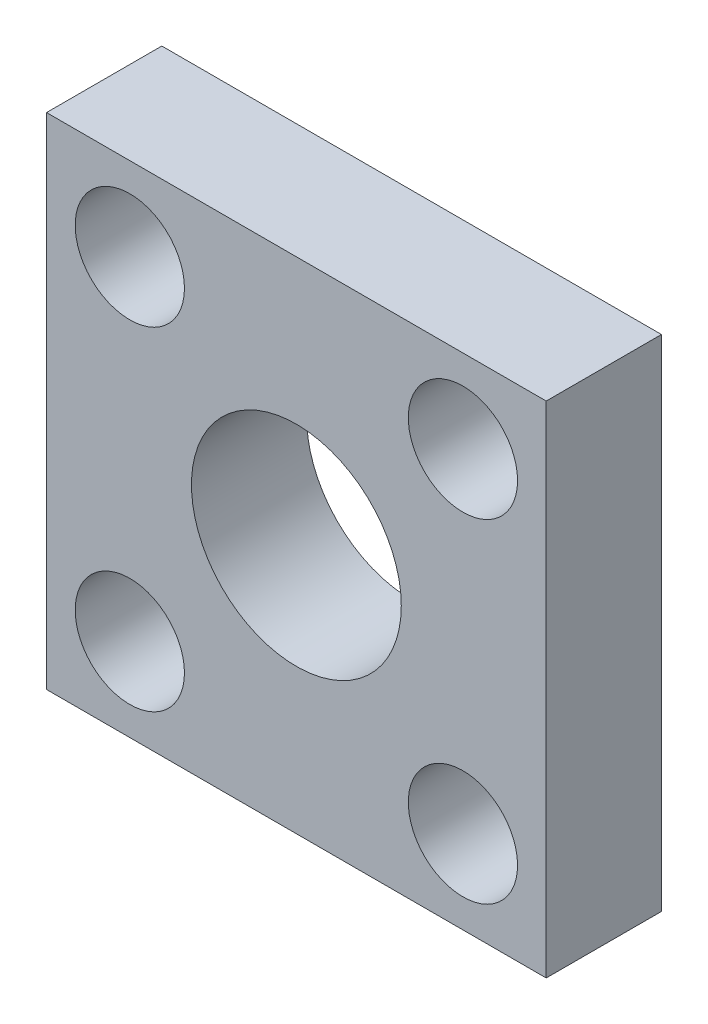
ISO-10303-21;
HEADER;
FILE_DESCRIPTION(('STEP AP214'),'2;1');
FILE_NAME('part.step','',(''),(''),'','','');
FILE_SCHEMA(('AUTOMOTIVE_DESIGN { 1 0 10303 214 1 1 1 1 }'));
ENDSEC;
DATA;
#1=APPLICATION_CONTEXT('core data for automotive mechanical design processes');
#2=APPLICATION_PROTOCOL_DEFINITION('international standard','automotive_design',2000,#1);
#3=PRODUCT_CONTEXT('',#1,'mechanical');
#4=PRODUCT('Part','Part','',(#3));
#5=PRODUCT_RELATED_PRODUCT_CATEGORY('part','',(#4));
#6=PRODUCT_DEFINITION_FORMATION('','',#4);
#7=PRODUCT_DEFINITION_CONTEXT('part definition',#1,'design');
#8=PRODUCT_DEFINITION('design','',#6,#7);
#9=PRODUCT_DEFINITION_SHAPE('','',#8);
#10=(LENGTH_UNIT() NAMED_UNIT(*) SI_UNIT(.MILLI.,.METRE.));
#11=(NAMED_UNIT(*) PLANE_ANGLE_UNIT() SI_UNIT($,.RADIAN.));
#12=(NAMED_UNIT(*) SI_UNIT($,.STERADIAN.) SOLID_ANGLE_UNIT());
#13=UNCERTAINTY_MEASURE_WITH_UNIT(LENGTH_MEASURE(1.E-05),#10,'distance_accuracy_value','');
#14=(GEOMETRIC_REPRESENTATION_CONTEXT(3) GLOBAL_UNCERTAINTY_ASSIGNED_CONTEXT((#13)) GLOBAL_UNIT_ASSIGNED_CONTEXT((#10,
#11,#12)) REPRESENTATION_CONTEXT('',''));
#15=CARTESIAN_POINT('',(0.,0.,0.));
#16=DIRECTION('',(0.,0.,1.));
#17=DIRECTION('',(1.,0.,0.));
#18=AXIS2_PLACEMENT_3D('',#15,#16,#17);
#19=CARTESIAN_POINT('',(0.,0.,4.3942));
#20=DIRECTION('',(0.,0.,-1.));
#21=DIRECTION('',(-1.,0.,0.));
#22=AXIS2_PLACEMENT_3D('',#19,#20,#21);
#23=PLANE('',#22);
#24=CARTESIAN_POINT('',(15.875,3.175,4.3942));
#25=DIRECTION('',(0.,0.,1.));
#26=DIRECTION('',(1.,0.,0.));
#27=AXIS2_PLACEMENT_3D('',#24,#25,#26);
#28=CIRCLE('',#27,2.0828);
#29=CARTESIAN_POINT('',(17.9578,3.175,4.3942));
#30=VERTEX_POINT('',#29);
#31=EDGE_CURVE('E127',#30,#30,#28,.T.);
#32=ORIENTED_EDGE('',*,*,#31,.F.);
#33=EDGE_LOOP('',(#32));
#34=FACE_BOUND('',#33,.T.);
#35=CARTESIAN_POINT('',(3.175,15.875,4.3942));
#36=DIRECTION('',(0.,0.,1.));
#37=DIRECTION('',(1.,0.,0.));
#38=AXIS2_PLACEMENT_3D('',#35,#36,#37);
#39=CIRCLE('',#38,2.08280000000002);
#40=CARTESIAN_POINT('',(5.25780000000002,15.875,4.3942));
#41=VERTEX_POINT('',#40);
#42=EDGE_CURVE('E115',#41,#41,#39,.T.);
#43=ORIENTED_EDGE('',*,*,#42,.F.);
#44=EDGE_LOOP('',(#43));
#45=FACE_BOUND('',#44,.T.);
#46=DIRECTION('',(0.,-1.,0.));
#47=VECTOR('',#46,1.);
#48=CARTESIAN_POINT('',(0.,0.,4.3942));
#49=LINE('',#48,#47);
#50=CARTESIAN_POINT('',(0.,19.05,4.3942));
#51=VERTEX_POINT('',#50);
#52=CARTESIAN_POINT('',(0.,0.,4.3942));
#53=VERTEX_POINT('',#52);
#54=EDGE_CURVE('E85',#51,#53,#49,.T.);
#55=ORIENTED_EDGE('',*,*,#54,.T.);
#56=DIRECTION('',(1.,0.,0.));
#57=VECTOR('',#56,1.);
#58=CARTESIAN_POINT('',(0.,0.,4.3942));
#59=LINE('',#58,#57);
#60=CARTESIAN_POINT('',(19.05,0.,4.3942));
#61=VERTEX_POINT('',#60);
#62=EDGE_CURVE('E80',#53,#61,#59,.T.);
#63=ORIENTED_EDGE('',*,*,#62,.T.);
#64=DIRECTION('',(0.,1.,0.));
#65=VECTOR('',#64,1.);
#66=CARTESIAN_POINT('',(19.05,0.,4.3942));
#67=LINE('',#66,#65);
#68=CARTESIAN_POINT('',(19.05,19.05,4.3942));
#69=VERTEX_POINT('',#68);
#70=EDGE_CURVE('E83',#61,#69,#67,.T.);
#71=ORIENTED_EDGE('',*,*,#70,.T.);
#72=DIRECTION('',(-1.,0.,0.));
#73=VECTOR('',#72,1.);
#74=CARTESIAN_POINT('',(0.,19.05,4.3942));
#75=LINE('',#74,#73);
#76=EDGE_CURVE('E50',#69,#51,#75,.T.);
#77=ORIENTED_EDGE('',*,*,#76,.T.);
#78=EDGE_LOOP('',(#55,#63,#71,#77));
#79=FACE_BOUND('',#78,.T.);
#80=CARTESIAN_POINT('',(3.175,3.175,4.3942));
#81=DIRECTION('',(0.,0.,1.));
#82=DIRECTION('',(1.,0.,0.));
#83=AXIS2_PLACEMENT_3D('',#80,#81,#82);
#84=CIRCLE('',#83,2.0828);
#85=CARTESIAN_POINT('',(5.2578,3.175,4.3942));
#86=VERTEX_POINT('',#85);
#87=EDGE_CURVE('E100',#86,#86,#84,.T.);
#88=ORIENTED_EDGE('',*,*,#87,.F.);
#89=EDGE_LOOP('',(#88));
#90=FACE_BOUND('',#89,.T.);
#91=CARTESIAN_POINT('',(15.875,15.875,4.3942));
#92=DIRECTION('',(0.,0.,1.));
#93=DIRECTION('',(1.,0.,0.));
#94=AXIS2_PLACEMENT_3D('',#91,#92,#93);
#95=CIRCLE('',#94,2.0828);
#96=CARTESIAN_POINT('',(17.9578,15.875,4.3942));
#97=VERTEX_POINT('',#96);
#98=EDGE_CURVE('E121',#97,#97,#95,.T.);
#99=ORIENTED_EDGE('',*,*,#98,.F.);
#100=EDGE_LOOP('',(#99));
#101=FACE_BOUND('',#100,.T.);
#102=CARTESIAN_POINT('',(9.525,9.525,4.3942));
#103=DIRECTION('',(0.,0.,1.));
#104=DIRECTION('',(1.,0.,0.));
#105=AXIS2_PLACEMENT_3D('',#102,#103,#104);
#106=CIRCLE('',#105,4.);
#107=CARTESIAN_POINT('',(13.525,9.525,4.3942));
#108=VERTEX_POINT('',#107);
#109=EDGE_CURVE('E133',#108,#108,#106,.T.);
#110=ORIENTED_EDGE('',*,*,#109,.F.);
#111=EDGE_LOOP('',(#110));
#112=FACE_BOUND('',#111,.T.);
#113=ADVANCED_FACE('F33',(#34,#45,#79,#90,#101,#112),#23,.F.);
#114=CARTESIAN_POINT('',(0.,0.,0.));
#115=DIRECTION('',(0.,0.,-1.));
#116=DIRECTION('',(-1.,0.,0.));
#117=AXIS2_PLACEMENT_3D('',#114,#115,#116);
#118=PLANE('',#117);
#119=CARTESIAN_POINT('',(15.875,3.175,0.));
#120=DIRECTION('',(0.,0.,1.));
#121=DIRECTION('',(1.,0.,0.));
#122=AXIS2_PLACEMENT_3D('',#119,#120,#121);
#123=CIRCLE('',#122,2.0828);
#124=CARTESIAN_POINT('',(17.9578,3.175,0.));
#125=VERTEX_POINT('',#124);
#126=EDGE_CURVE('E130',#125,#125,#123,.T.);
#127=ORIENTED_EDGE('',*,*,#126,.T.);
#128=EDGE_LOOP('',(#127));
#129=FACE_BOUND('',#128,.T.);
#130=CARTESIAN_POINT('',(3.175,15.875,0.));
#131=DIRECTION('',(0.,0.,1.));
#132=DIRECTION('',(1.,0.,0.));
#133=AXIS2_PLACEMENT_3D('',#130,#131,#132);
#134=CIRCLE('',#133,2.08280000000002);
#135=CARTESIAN_POINT('',(5.25780000000002,15.875,0.));
#136=VERTEX_POINT('',#135);
#137=EDGE_CURVE('E118',#136,#136,#134,.T.);
#138=ORIENTED_EDGE('',*,*,#137,.T.);
#139=EDGE_LOOP('',(#138));
#140=FACE_BOUND('',#139,.T.);
#141=DIRECTION('',(0.,-1.,0.));
#142=VECTOR('',#141,1.);
#143=CARTESIAN_POINT('',(0.,0.,0.));
#144=LINE('',#143,#142);
#145=CARTESIAN_POINT('',(0.,19.05,0.));
#146=VERTEX_POINT('',#145);
#147=CARTESIAN_POINT('',(0.,0.,0.));
#148=VERTEX_POINT('',#147);
#149=EDGE_CURVE('E97',#146,#148,#144,.T.);
#150=ORIENTED_EDGE('',*,*,#149,.F.);
#151=DIRECTION('',(-1.,0.,0.));
#152=VECTOR('',#151,1.);
#153=CARTESIAN_POINT('',(0.,19.05,0.));
#154=LINE('',#153,#152);
#155=CARTESIAN_POINT('',(19.05,19.05,0.));
#156=VERTEX_POINT('',#155);
#157=EDGE_CURVE('E73',#156,#146,#154,.T.);
#158=ORIENTED_EDGE('',*,*,#157,.F.);
#159=DIRECTION('',(0.,1.,0.));
#160=VECTOR('',#159,1.);
#161=CARTESIAN_POINT('',(19.05,0.,0.));
#162=LINE('',#161,#160);
#163=CARTESIAN_POINT('',(19.05,0.,0.));
#164=VERTEX_POINT('',#163);
#165=EDGE_CURVE('E67',#164,#156,#162,.T.);
#166=ORIENTED_EDGE('',*,*,#165,.F.);
#167=DIRECTION('',(1.,0.,0.));
#168=VECTOR('',#167,1.);
#169=CARTESIAN_POINT('',(0.,0.,0.));
#170=LINE('',#169,#168);
#171=EDGE_CURVE('E89',#148,#164,#170,.T.);
#172=ORIENTED_EDGE('',*,*,#171,.F.);
#173=EDGE_LOOP('',(#150,#158,#166,#172));
#174=FACE_BOUND('',#173,.T.);
#175=CARTESIAN_POINT('',(3.175,3.175,0.));
#176=DIRECTION('',(0.,0.,1.));
#177=DIRECTION('',(1.,0.,0.));
#178=AXIS2_PLACEMENT_3D('',#175,#176,#177);
#179=CIRCLE('',#178,2.0828);
#180=CARTESIAN_POINT('',(5.2578,3.175,0.));
#181=VERTEX_POINT('',#180);
#182=EDGE_CURVE('E112',#181,#181,#179,.T.);
#183=ORIENTED_EDGE('',*,*,#182,.T.);
#184=EDGE_LOOP('',(#183));
#185=FACE_BOUND('',#184,.T.);
#186=CARTESIAN_POINT('',(15.875,15.875,0.));
#187=DIRECTION('',(0.,0.,1.));
#188=DIRECTION('',(1.,0.,0.));
#189=AXIS2_PLACEMENT_3D('',#186,#187,#188);
#190=CIRCLE('',#189,2.0828);
#191=CARTESIAN_POINT('',(17.9578,15.875,0.));
#192=VERTEX_POINT('',#191);
#193=EDGE_CURVE('E124',#192,#192,#190,.T.);
#194=ORIENTED_EDGE('',*,*,#193,.T.);
#195=EDGE_LOOP('',(#194));
#196=FACE_BOUND('',#195,.T.);
#197=CARTESIAN_POINT('',(9.525,9.525,0.));
#198=DIRECTION('',(0.,0.,1.));
#199=DIRECTION('',(1.,0.,0.));
#200=AXIS2_PLACEMENT_3D('',#197,#198,#199);
#201=CIRCLE('',#200,4.);
#202=CARTESIAN_POINT('',(13.525,9.525,0.));
#203=VERTEX_POINT('',#202);
#204=EDGE_CURVE('E136',#203,#203,#201,.T.);
#205=ORIENTED_EDGE('',*,*,#204,.T.);
#206=EDGE_LOOP('',(#205));
#207=FACE_BOUND('',#206,.T.);
#208=ADVANCED_FACE('F108',(#129,#140,#174,#185,#196,#207),#118,.T.);
#209=CARTESIAN_POINT('',(0.,0.,4.3942));
#210=DIRECTION('',(1.,0.,0.));
#211=DIRECTION('',(0.,0.,-1.));
#212=AXIS2_PLACEMENT_3D('',#209,#210,#211);
#213=PLANE('',#212);
#214=ORIENTED_EDGE('',*,*,#149,.T.);
#215=DIRECTION('',(0.,0.,-1.));
#216=VECTOR('',#215,1.);
#217=CARTESIAN_POINT('',(0.,0.,4.3942));
#218=LINE('',#217,#216);
#219=EDGE_CURVE('E11',#53,#148,#218,.T.);
#220=ORIENTED_EDGE('',*,*,#219,.F.);
#221=ORIENTED_EDGE('',*,*,#54,.F.);
#222=DIRECTION('',(0.,0.,-1.));
#223=VECTOR('',#222,1.);
#224=CARTESIAN_POINT('',(0.,19.05,4.3942));
#225=LINE('',#224,#223);
#226=EDGE_CURVE('E93',#51,#146,#225,.T.);
#227=ORIENTED_EDGE('',*,*,#226,.T.);
#228=EDGE_LOOP('',(#214,#220,#221,#227));
#229=FACE_BOUND('',#228,.T.);
#230=ADVANCED_FACE('F35',(#229),#213,.F.);
#231=CARTESIAN_POINT('',(0.,0.,4.3942));
#232=DIRECTION('',(0.,1.,0.));
#233=DIRECTION('',(0.,0.,1.));
#234=AXIS2_PLACEMENT_3D('',#231,#232,#233);
#235=PLANE('',#234);
#236=ORIENTED_EDGE('',*,*,#171,.T.);
#237=DIRECTION('',(0.,0.,-1.));
#238=VECTOR('',#237,1.);
#239=CARTESIAN_POINT('',(19.05,0.,4.3942));
#240=LINE('',#239,#238);
#241=EDGE_CURVE('E42',#61,#164,#240,.T.);
#242=ORIENTED_EDGE('',*,*,#241,.F.);
#243=ORIENTED_EDGE('',*,*,#62,.F.);
#244=ORIENTED_EDGE('',*,*,#219,.T.);
#245=EDGE_LOOP('',(#236,#242,#243,#244));
#246=FACE_BOUND('',#245,.T.);
#247=ADVANCED_FACE('F88',(#246),#235,.F.);
#248=CARTESIAN_POINT('',(19.05,0.,4.3942));
#249=DIRECTION('',(-1.,0.,0.));
#250=DIRECTION('',(0.,0.,1.));
#251=AXIS2_PLACEMENT_3D('',#248,#249,#250);
#252=PLANE('',#251);
#253=ORIENTED_EDGE('',*,*,#165,.T.);
#254=DIRECTION('',(0.,0.,-1.));
#255=VECTOR('',#254,1.);
#256=CARTESIAN_POINT('',(19.05,19.05,4.3942));
#257=LINE('',#256,#255);
#258=EDGE_CURVE('E90',#69,#156,#257,.T.);
#259=ORIENTED_EDGE('',*,*,#258,.F.);
#260=ORIENTED_EDGE('',*,*,#70,.F.);
#261=ORIENTED_EDGE('',*,*,#241,.T.);
#262=EDGE_LOOP('',(#253,#259,#260,#261));
#263=FACE_BOUND('',#262,.T.);
#264=ADVANCED_FACE('F91',(#263),#252,.F.);
#265=CARTESIAN_POINT('',(0.,19.05,4.3942));
#266=DIRECTION('',(0.,-1.,0.));
#267=DIRECTION('',(0.,0.,-1.));
#268=AXIS2_PLACEMENT_3D('',#265,#266,#267);
#269=PLANE('',#268);
#270=ORIENTED_EDGE('',*,*,#157,.T.);
#271=ORIENTED_EDGE('',*,*,#226,.F.);
#272=ORIENTED_EDGE('',*,*,#76,.F.);
#273=ORIENTED_EDGE('',*,*,#258,.T.);
#274=EDGE_LOOP('',(#270,#271,#272,#273));
#275=FACE_BOUND('',#274,.T.);
#276=ADVANCED_FACE('F105',(#275),#269,.F.);
#277=CARTESIAN_POINT('',(3.175,3.175,4.3942));
#278=DIRECTION('',(0.,0.,-1.));
#279=DIRECTION('',(-1.,0.,0.));
#280=AXIS2_PLACEMENT_3D('',#277,#278,#279);
#281=CYLINDRICAL_SURFACE('',#280,2.0828);
#282=ORIENTED_EDGE('',*,*,#87,.T.);
#283=EDGE_LOOP('',(#282));
#284=FACE_BOUND('',#283,.T.);
#285=ORIENTED_EDGE('',*,*,#182,.F.);
#286=EDGE_LOOP('',(#285));
#287=FACE_BOUND('',#286,.T.);
#288=ADVANCED_FACE('F156',(#284,#287),#281,.F.);
#289=CARTESIAN_POINT('',(3.175,15.875,4.3942));
#290=DIRECTION('',(0.,0.,-1.));
#291=DIRECTION('',(-1.,0.,0.));
#292=AXIS2_PLACEMENT_3D('',#289,#290,#291);
#293=CYLINDRICAL_SURFACE('',#292,2.08280000000002);
#294=ORIENTED_EDGE('',*,*,#42,.T.);
#295=EDGE_LOOP('',(#294));
#296=FACE_BOUND('',#295,.T.);
#297=ORIENTED_EDGE('',*,*,#137,.F.);
#298=EDGE_LOOP('',(#297));
#299=FACE_BOUND('',#298,.T.);
#300=ADVANCED_FACE('F202',(#296,#299),#293,.F.);
#301=CARTESIAN_POINT('',(15.875,15.875,4.3942));
#302=DIRECTION('',(0.,0.,-1.));
#303=DIRECTION('',(-1.,0.,0.));
#304=AXIS2_PLACEMENT_3D('',#301,#302,#303);
#305=CYLINDRICAL_SURFACE('',#304,2.0828);
#306=ORIENTED_EDGE('',*,*,#98,.T.);
#307=EDGE_LOOP('',(#306));
#308=FACE_BOUND('',#307,.T.);
#309=ORIENTED_EDGE('',*,*,#193,.F.);
#310=EDGE_LOOP('',(#309));
#311=FACE_BOUND('',#310,.T.);
#312=ADVANCED_FACE('F210',(#308,#311),#305,.F.);
#313=CARTESIAN_POINT('',(15.875,3.175,4.3942));
#314=DIRECTION('',(0.,0.,-1.));
#315=DIRECTION('',(-1.,0.,0.));
#316=AXIS2_PLACEMENT_3D('',#313,#314,#315);
#317=CYLINDRICAL_SURFACE('',#316,2.0828);
#318=ORIENTED_EDGE('',*,*,#31,.T.);
#319=EDGE_LOOP('',(#318));
#320=FACE_BOUND('',#319,.T.);
#321=ORIENTED_EDGE('',*,*,#126,.F.);
#322=EDGE_LOOP('',(#321));
#323=FACE_BOUND('',#322,.T.);
#324=ADVANCED_FACE('F218',(#320,#323),#317,.F.);
#325=CARTESIAN_POINT('',(9.525,9.525,4.3942));
#326=DIRECTION('',(0.,0.,-1.));
#327=DIRECTION('',(-1.,0.,0.));
#328=AXIS2_PLACEMENT_3D('',#325,#326,#327);
#329=CYLINDRICAL_SURFACE('',#328,4.);
#330=ORIENTED_EDGE('',*,*,#109,.T.);
#331=EDGE_LOOP('',(#330));
#332=FACE_BOUND('',#331,.T.);
#333=ORIENTED_EDGE('',*,*,#204,.F.);
#334=EDGE_LOOP('',(#333));
#335=FACE_BOUND('',#334,.T.);
#336=ADVANCED_FACE('F142',(#332,#335),#329,.F.);
#337=CLOSED_SHELL('',(#113,#208,#230,#247,#264,#276,#288,#300,#312,#324,#336));
#338=MANIFOLD_SOLID_BREP('B2',#337);
#339=ADVANCED_BREP_SHAPE_REPRESENTATION('',(#18,#338),#14);
#340=SHAPE_DEFINITION_REPRESENTATION(#9,#339);
ENDSEC;
END-ISO-10303-21;
